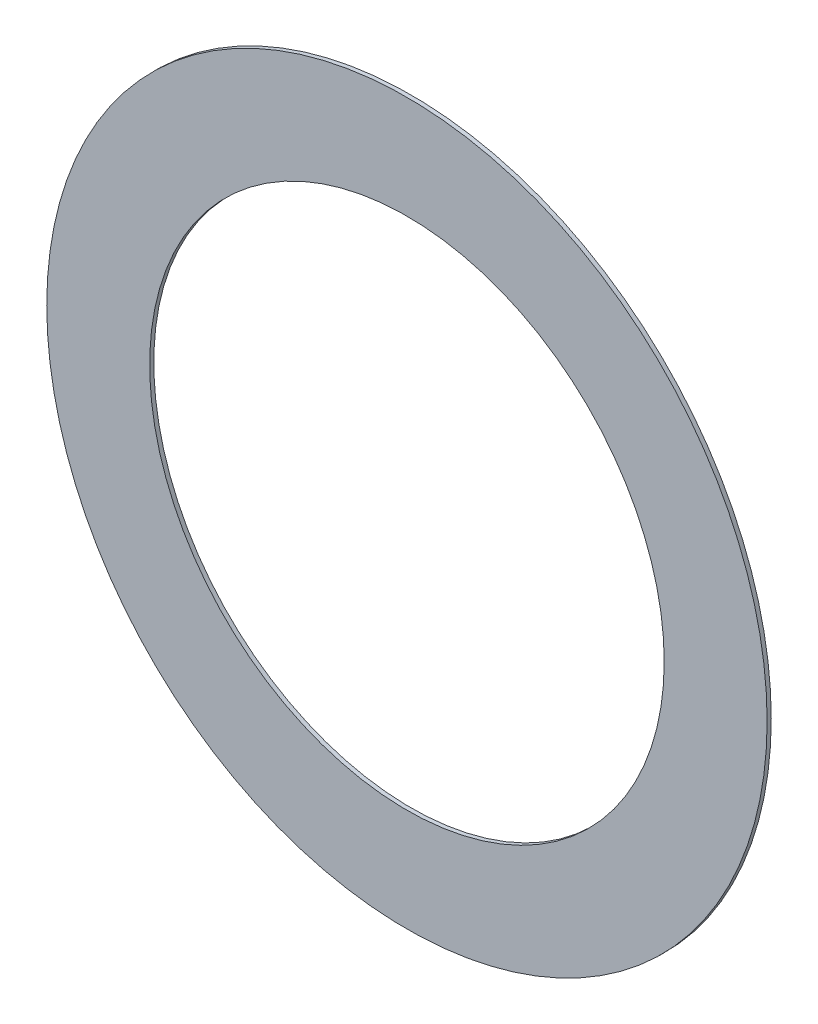
ISO-10303-21;
HEADER;
FILE_DESCRIPTION(('STEP AP214'),'2;1');
FILE_NAME('part.step','',(''),(''),'','','');
FILE_SCHEMA(('AUTOMOTIVE_DESIGN { 1 0 10303 214 1 1 1 1 }'));
ENDSEC;
DATA;
#1=APPLICATION_CONTEXT('core data for automotive mechanical design processes');
#2=APPLICATION_PROTOCOL_DEFINITION('international standard','automotive_design',2000,#1);
#3=PRODUCT_CONTEXT('',#1,'mechanical');
#4=PRODUCT('Part','Part','',(#3));
#5=PRODUCT_RELATED_PRODUCT_CATEGORY('part','',(#4));
#6=PRODUCT_DEFINITION_FORMATION('','',#4);
#7=PRODUCT_DEFINITION_CONTEXT('part definition',#1,'design');
#8=PRODUCT_DEFINITION('design','',#6,#7);
#9=PRODUCT_DEFINITION_SHAPE('','',#8);
#10=(LENGTH_UNIT() NAMED_UNIT(*) SI_UNIT(.MILLI.,.METRE.));
#11=(NAMED_UNIT(*) PLANE_ANGLE_UNIT() SI_UNIT($,.RADIAN.));
#12=(NAMED_UNIT(*) SI_UNIT($,.STERADIAN.) SOLID_ANGLE_UNIT());
#13=UNCERTAINTY_MEASURE_WITH_UNIT(LENGTH_MEASURE(1.E-05),#10,'distance_accuracy_value','');
#14=(GEOMETRIC_REPRESENTATION_CONTEXT(3) GLOBAL_UNCERTAINTY_ASSIGNED_CONTEXT((#13)) GLOBAL_UNIT_ASSIGNED_CONTEXT((#10,
#11,#12)) REPRESENTATION_CONTEXT('',''));
#15=CARTESIAN_POINT('',(0.,0.,0.));
#16=DIRECTION('',(0.,0.,1.));
#17=DIRECTION('',(1.,0.,0.));
#18=AXIS2_PLACEMENT_3D('',#15,#16,#17);
#19=CARTESIAN_POINT('',(0.,0.,0.254));
#20=DIRECTION('',(0.,0.,1.));
#21=DIRECTION('',(1.,0.,0.));
#22=AXIS2_PLACEMENT_3D('',#19,#20,#21);
#23=PLANE('',#22);
#24=CARTESIAN_POINT('',(0.,0.,0.254));
#25=DIRECTION('',(0.,0.,1.));
#26=DIRECTION('',(1.,0.,0.));
#27=AXIS2_PLACEMENT_3D('',#24,#25,#26);
#28=CIRCLE('',#27,22.225);
#29=CARTESIAN_POINT('',(22.225,0.,0.254));
#30=VERTEX_POINT('',#29);
#31=EDGE_CURVE('E10',#30,#30,#28,.T.);
#32=ORIENTED_EDGE('',*,*,#31,.T.);
#33=EDGE_LOOP('',(#32));
#34=FACE_BOUND('',#33,.T.);
#35=CARTESIAN_POINT('',(0.,0.,0.254));
#36=DIRECTION('',(0.,0.,1.));
#37=DIRECTION('',(1.,0.,0.));
#38=AXIS2_PLACEMENT_3D('',#35,#36,#37);
#39=CIRCLE('',#38,15.875);
#40=CARTESIAN_POINT('',(15.875,0.,0.254));
#41=VERTEX_POINT('',#40);
#42=EDGE_CURVE('E42',#41,#41,#39,.T.);
#43=ORIENTED_EDGE('',*,*,#42,.F.);
#44=EDGE_LOOP('',(#43));
#45=FACE_BOUND('',#44,.T.);
#46=ADVANCED_FACE('F31',(#34,#45),#23,.T.);
#47=CARTESIAN_POINT('',(0.,0.,0.));
#48=DIRECTION('',(0.,0.,1.));
#49=DIRECTION('',(1.,0.,0.));
#50=AXIS2_PLACEMENT_3D('',#47,#48,#49);
#51=PLANE('',#50);
#52=CARTESIAN_POINT('',(0.,0.,0.));
#53=DIRECTION('',(0.,0.,1.));
#54=DIRECTION('',(1.,0.,0.));
#55=AXIS2_PLACEMENT_3D('',#52,#53,#54);
#56=CIRCLE('',#55,22.225);
#57=CARTESIAN_POINT('',(22.225,0.,0.));
#58=VERTEX_POINT('',#57);
#59=EDGE_CURVE('E35',#58,#58,#56,.T.);
#60=ORIENTED_EDGE('',*,*,#59,.F.);
#61=EDGE_LOOP('',(#60));
#62=FACE_BOUND('',#61,.T.);
#63=CARTESIAN_POINT('',(0.,0.,0.));
#64=DIRECTION('',(0.,0.,1.));
#65=DIRECTION('',(1.,0.,0.));
#66=AXIS2_PLACEMENT_3D('',#63,#64,#65);
#67=CIRCLE('',#66,15.875);
#68=CARTESIAN_POINT('',(15.875,0.,0.));
#69=VERTEX_POINT('',#68);
#70=EDGE_CURVE('E44',#69,#69,#67,.T.);
#71=ORIENTED_EDGE('',*,*,#70,.T.);
#72=EDGE_LOOP('',(#71));
#73=FACE_BOUND('',#72,.T.);
#74=ADVANCED_FACE('F54',(#62,#73),#51,.F.);
#75=CARTESIAN_POINT('',(0.,0.,0.254));
#76=DIRECTION('',(0.,0.,-1.));
#77=DIRECTION('',(-1.,0.,0.));
#78=AXIS2_PLACEMENT_3D('',#75,#76,#77);
#79=CYLINDRICAL_SURFACE('',#78,22.225);
#80=ORIENTED_EDGE('',*,*,#31,.F.);
#81=EDGE_LOOP('',(#80));
#82=FACE_BOUND('',#81,.T.);
#83=ORIENTED_EDGE('',*,*,#59,.T.);
#84=EDGE_LOOP('',(#83));
#85=FACE_BOUND('',#84,.T.);
#86=ADVANCED_FACE('F33',(#82,#85),#79,.T.);
#87=CARTESIAN_POINT('',(0.,0.,0.254));
#88=DIRECTION('',(0.,0.,-1.));
#89=DIRECTION('',(-1.,0.,0.));
#90=AXIS2_PLACEMENT_3D('',#87,#88,#89);
#91=CYLINDRICAL_SURFACE('',#90,15.875);
#92=ORIENTED_EDGE('',*,*,#42,.T.);
#93=EDGE_LOOP('',(#92));
#94=FACE_BOUND('',#93,.T.);
#95=ORIENTED_EDGE('',*,*,#70,.F.);
#96=EDGE_LOOP('',(#95));
#97=FACE_BOUND('',#96,.T.);
#98=ADVANCED_FACE('F50',(#94,#97),#91,.F.);
#99=CLOSED_SHELL('',(#46,#74,#86,#98));
#100=MANIFOLD_SOLID_BREP('B2',#99);
#101=ADVANCED_BREP_SHAPE_REPRESENTATION('',(#18,#100),#14);
#102=SHAPE_DEFINITION_REPRESENTATION(#9,#101);
ENDSEC;
END-ISO-10303-21;
